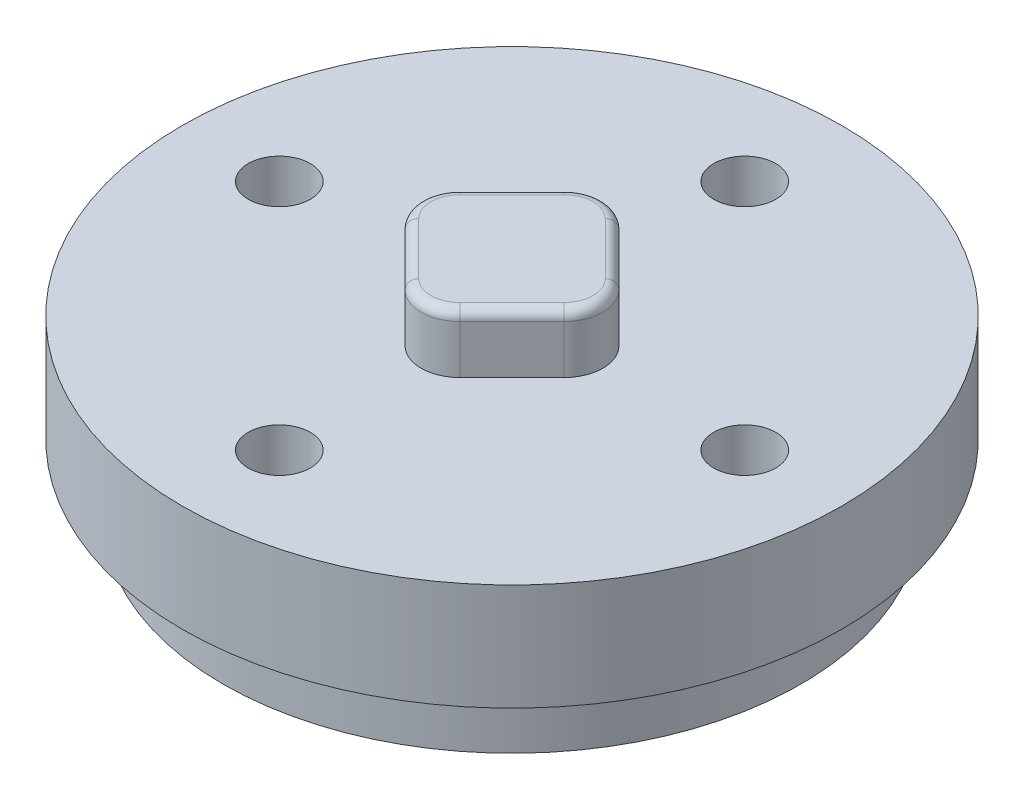
ISO-10303-21;
HEADER;
FILE_DESCRIPTION(('STEP AP214'),'2;1');
FILE_NAME('part.step','',(''),(''),'','','');
FILE_SCHEMA(('AUTOMOTIVE_DESIGN { 1 0 10303 214 1 1 1 1 }'));
ENDSEC;
DATA;
#1=APPLICATION_CONTEXT('core data for automotive mechanical design processes');
#2=APPLICATION_PROTOCOL_DEFINITION('international standard','automotive_design',2000,#1);
#3=PRODUCT_CONTEXT('',#1,'mechanical');
#4=PRODUCT('Part','Part','',(#3));
#5=PRODUCT_RELATED_PRODUCT_CATEGORY('part','',(#4));
#6=PRODUCT_DEFINITION_FORMATION('','',#4);
#7=PRODUCT_DEFINITION_CONTEXT('part definition',#1,'design');
#8=PRODUCT_DEFINITION('design','',#6,#7);
#9=PRODUCT_DEFINITION_SHAPE('','',#8);
#10=(LENGTH_UNIT() NAMED_UNIT(*) SI_UNIT(.MILLI.,.METRE.));
#11=(NAMED_UNIT(*) PLANE_ANGLE_UNIT() SI_UNIT($,.RADIAN.));
#12=(NAMED_UNIT(*) SI_UNIT($,.STERADIAN.) SOLID_ANGLE_UNIT());
#13=UNCERTAINTY_MEASURE_WITH_UNIT(LENGTH_MEASURE(1.E-05),#10,'distance_accuracy_value','');
#14=(GEOMETRIC_REPRESENTATION_CONTEXT(3) GLOBAL_UNCERTAINTY_ASSIGNED_CONTEXT((#13)) GLOBAL_UNIT_ASSIGNED_CONTEXT((#10,
#11,#12)) REPRESENTATION_CONTEXT('',''));
#15=CARTESIAN_POINT('',(0.,0.,0.));
#16=DIRECTION('',(0.,0.,1.));
#17=DIRECTION('',(1.,0.,0.));
#18=AXIS2_PLACEMENT_3D('',#15,#16,#17);
#19=CARTESIAN_POINT('',(0.,9.,0.));
#20=DIRECTION('',(0.,1.,0.));
#21=DIRECTION('',(0.,0.,1.));
#22=AXIS2_PLACEMENT_3D('',#19,#20,#21);
#23=PLANE('',#22);
#24=CARTESIAN_POINT('',(-11.9999999999997,9.,3.4032572508536E-13));
#25=DIRECTION('',(0.,1.,0.));
#26=DIRECTION('',(0.,0.,1.));
#27=AXIS2_PLACEMENT_3D('',#24,#25,#26);
#28=CIRCLE('',#27,1.6);
#29=CARTESIAN_POINT('',(-11.9999999999997,9.,1.60000000000034));
#30=VERTEX_POINT('',#29);
#31=EDGE_CURVE('E183',#30,#30,#28,.T.);
#32=ORIENTED_EDGE('',*,*,#31,.F.);
#33=EDGE_LOOP('',(#32));
#34=FACE_BOUND('',#33,.T.);
#35=CARTESIAN_POINT('',(12.0000000000003,9.,-3.38856148926383E-13));
#36=DIRECTION('',(0.,1.,0.));
#37=DIRECTION('',(0.,0.,1.));
#38=AXIS2_PLACEMENT_3D('',#35,#36,#37);
#39=CIRCLE('',#38,1.6);
#40=CARTESIAN_POINT('',(12.0000000000003,9.,1.59999999999966));
#41=VERTEX_POINT('',#40);
#42=EDGE_CURVE('E189',#41,#41,#39,.T.);
#43=ORIENTED_EDGE('',*,*,#42,.F.);
#44=EDGE_LOOP('',(#43));
#45=FACE_BOUND('',#44,.T.);
#46=CARTESIAN_POINT('',(0.,9.,0.));
#47=DIRECTION('',(0.,1.,0.));
#48=DIRECTION('',(0.,0.,1.));
#49=AXIS2_PLACEMENT_3D('',#46,#47,#48);
#50=CIRCLE('',#49,17.);
#51=CARTESIAN_POINT('',(0.,9.,17.));
#52=VERTEX_POINT('',#51);
#53=EDGE_CURVE('E193',#52,#52,#50,.T.);
#54=ORIENTED_EDGE('',*,*,#53,.T.);
#55=EDGE_LOOP('',(#54));
#56=FACE_BOUND('',#55,.T.);
#57=CARTESIAN_POINT('',(6.77712297852766E-13,9.,12.));
#58=DIRECTION('',(0.,1.,0.));
#59=DIRECTION('',(0.,0.,1.));
#60=AXIS2_PLACEMENT_3D('',#57,#58,#59);
#61=CIRCLE('',#60,1.6);
#62=CARTESIAN_POINT('',(6.77712297852766E-13,9.,13.6));
#63=VERTEX_POINT('',#62);
#64=EDGE_CURVE('E186',#63,#63,#61,.T.);
#65=ORIENTED_EDGE('',*,*,#64,.F.);
#66=EDGE_LOOP('',(#65));
#67=FACE_BOUND('',#66,.T.);
#68=CARTESIAN_POINT('',(0.,9.,-12.));
#69=DIRECTION('',(0.,1.,0.));
#70=DIRECTION('',(0.,0.,1.));
#71=AXIS2_PLACEMENT_3D('',#68,#69,#70);
#72=CIRCLE('',#71,1.6);
#73=CARTESIAN_POINT('',(0.,9.,-10.4));
#74=VERTEX_POINT('',#73);
#75=EDGE_CURVE('E138',#74,#74,#72,.T.);
#76=ORIENTED_EDGE('',*,*,#75,.F.);
#77=EDGE_LOOP('',(#76));
#78=FACE_BOUND('',#77,.T.);
#79=DIRECTION('',(-0.707106781186548,0.,-0.707106781186547));
#80=VECTOR('',#79,1.);
#81=CARTESIAN_POINT('',(1.41421356237309,9.,-4.10121933088198));
#82=LINE('',#81,#80);
#83=CARTESIAN_POINT('',(4.10121933088198,9.,-1.41421356237309));
#84=VERTEX_POINT('',#83);
#85=CARTESIAN_POINT('',(1.41421356237309,9.,-4.10121933088198));
#86=VERTEX_POINT('',#85);
#87=EDGE_CURVE('E135',#84,#86,#82,.T.);
#88=ORIENTED_EDGE('',*,*,#87,.F.);
#89=CARTESIAN_POINT('',(2.68700576850888,9.,0.));
#90=DIRECTION('',(0.,1.,0.));
#91=DIRECTION('',(0.,0.,-1.));
#92=AXIS2_PLACEMENT_3D('',#89,#90,#91);
#93=CIRCLE('',#92,2.);
#94=CARTESIAN_POINT('',(4.10121933088198,9.,1.41421356237309));
#95=VERTEX_POINT('',#94);
#96=EDGE_CURVE('E142',#95,#84,#93,.T.);
#97=ORIENTED_EDGE('',*,*,#96,.F.);
#98=DIRECTION('',(0.707106781186547,0.,-0.707106781186548));
#99=VECTOR('',#98,1.);
#100=CARTESIAN_POINT('',(1.4142135623731,9.,4.10121933088198));
#101=LINE('',#100,#99);
#102=CARTESIAN_POINT('',(1.4142135623731,9.,4.10121933088198));
#103=VERTEX_POINT('',#102);
#104=EDGE_CURVE('E167',#103,#95,#101,.T.);
#105=ORIENTED_EDGE('',*,*,#104,.F.);
#106=CARTESIAN_POINT('',(0.,9.,2.68700576850888));
#107=DIRECTION('',(0.,1.,0.));
#108=DIRECTION('',(0.,0.,1.));
#109=AXIS2_PLACEMENT_3D('',#106,#107,#108);
#110=CIRCLE('',#109,2.);
#111=CARTESIAN_POINT('',(-1.41421356237309,9.,4.10121933088198));
#112=VERTEX_POINT('',#111);
#113=EDGE_CURVE('E164',#112,#103,#110,.T.);
#114=ORIENTED_EDGE('',*,*,#113,.F.);
#115=DIRECTION('',(0.707106781186547,0.,0.707106781186548));
#116=VECTOR('',#115,1.);
#117=CARTESIAN_POINT('',(-4.10121933088198,9.,1.41421356237309));
#118=LINE('',#117,#116);
#119=CARTESIAN_POINT('',(-4.10121933088198,9.,1.41421356237309));
#120=VERTEX_POINT('',#119);
#121=EDGE_CURVE('E161',#120,#112,#118,.T.);
#122=ORIENTED_EDGE('',*,*,#121,.F.);
#123=CARTESIAN_POINT('',(-2.68700576850888,9.,0.));
#124=DIRECTION('',(0.,1.,0.));
#125=DIRECTION('',(0.,0.,-1.));
#126=AXIS2_PLACEMENT_3D('',#123,#124,#125);
#127=CIRCLE('',#126,2.);
#128=CARTESIAN_POINT('',(-4.10121933088198,9.,-1.41421356237309));
#129=VERTEX_POINT('',#128);
#130=EDGE_CURVE('E158',#129,#120,#127,.T.);
#131=ORIENTED_EDGE('',*,*,#130,.F.);
#132=DIRECTION('',(-0.707106781186547,0.,0.707106781186548));
#133=VECTOR('',#132,1.);
#134=CARTESIAN_POINT('',(-4.10121933088198,9.,-1.41421356237309));
#135=LINE('',#134,#133);
#136=CARTESIAN_POINT('',(-1.4142135623731,9.,-4.10121933088198));
#137=VERTEX_POINT('',#136);
#138=EDGE_CURVE('E153',#137,#129,#135,.T.);
#139=ORIENTED_EDGE('',*,*,#138,.F.);
#140=CARTESIAN_POINT('',(0.,9.,-2.68700576850888));
#141=DIRECTION('',(0.,1.,0.));
#142=DIRECTION('',(0.,0.,-1.));
#143=AXIS2_PLACEMENT_3D('',#140,#141,#142);
#144=CIRCLE('',#143,2.);
#145=EDGE_CURVE('E151',#86,#137,#144,.T.);
#146=ORIENTED_EDGE('',*,*,#145,.F.);
#147=EDGE_LOOP('',(#88,#97,#105,#114,#122,#131,#139,#146));
#148=FACE_BOUND('',#147,.T.);
#149=ADVANCED_FACE('F43',(#34,#45,#56,#67,#78,#148),#23,.T.);
#150=CARTESIAN_POINT('',(0.,3.5,0.));
#151=DIRECTION('',(0.,-1.,0.));
#152=DIRECTION('',(0.,0.,-1.));
#153=AXIS2_PLACEMENT_3D('',#150,#151,#152);
#154=CYLINDRICAL_SURFACE('',#153,14.9);
#155=CARTESIAN_POINT('',(0.,3.5,0.));
#156=DIRECTION('',(0.,1.,0.));
#157=DIRECTION('',(0.,0.,1.));
#158=AXIS2_PLACEMENT_3D('',#155,#156,#157);
#159=CIRCLE('',#158,14.9);
#160=CARTESIAN_POINT('',(0.,3.5,14.9));
#161=VERTEX_POINT('',#160);
#162=EDGE_CURVE('E199',#161,#161,#159,.T.);
#163=ORIENTED_EDGE('',*,*,#162,.F.);
#164=EDGE_LOOP('',(#163));
#165=FACE_BOUND('',#164,.T.);
#166=CARTESIAN_POINT('',(0.,0.,0.));
#167=DIRECTION('',(0.,1.,0.));
#168=DIRECTION('',(0.,0.,1.));
#169=AXIS2_PLACEMENT_3D('',#166,#167,#168);
#170=CIRCLE('',#169,14.9);
#171=CARTESIAN_POINT('',(0.,0.,14.9));
#172=VERTEX_POINT('',#171);
#173=EDGE_CURVE('E203',#172,#172,#170,.T.);
#174=ORIENTED_EDGE('',*,*,#173,.T.);
#175=EDGE_LOOP('',(#174));
#176=FACE_BOUND('',#175,.T.);
#177=ADVANCED_FACE('F346',(#165,#176),#154,.T.);
#178=CARTESIAN_POINT('',(0.,3.5,-12.));
#179=DIRECTION('',(0.,-1.,0.));
#180=DIRECTION('',(0.,0.,-1.));
#181=AXIS2_PLACEMENT_3D('',#178,#179,#180);
#182=CYLINDRICAL_SURFACE('',#181,1.6);
#183=CARTESIAN_POINT('',(0.,0.,-12.));
#184=DIRECTION('',(0.,1.,0.));
#185=DIRECTION('',(0.,0.,1.));
#186=AXIS2_PLACEMENT_3D('',#183,#184,#185);
#187=CIRCLE('',#186,1.6);
#188=CARTESIAN_POINT('',(0.,0.,-10.4));
#189=VERTEX_POINT('',#188);
#190=EDGE_CURVE('E212',#189,#189,#187,.T.);
#191=ORIENTED_EDGE('',*,*,#190,.F.);
#192=EDGE_LOOP('',(#191));
#193=FACE_BOUND('',#192,.T.);
#194=ORIENTED_EDGE('',*,*,#75,.T.);
#195=EDGE_LOOP('',(#194));
#196=FACE_BOUND('',#195,.T.);
#197=ADVANCED_FACE('F352',(#193,#196),#182,.F.);
#198=CARTESIAN_POINT('',(12.0000000000003,3.5,-3.38856148926383E-13));
#199=DIRECTION('',(0.,-1.,0.));
#200=DIRECTION('',(0.,0.,-1.));
#201=AXIS2_PLACEMENT_3D('',#198,#199,#200);
#202=CYLINDRICAL_SURFACE('',#201,1.6);
#203=CARTESIAN_POINT('',(12.0000000000003,0.,-3.38856148926383E-13));
#204=DIRECTION('',(0.,1.,0.));
#205=DIRECTION('',(0.,0.,1.));
#206=AXIS2_PLACEMENT_3D('',#203,#204,#205);
#207=CIRCLE('',#206,1.6);
#208=CARTESIAN_POINT('',(12.0000000000003,0.,1.59999999999966));
#209=VERTEX_POINT('',#208);
#210=EDGE_CURVE('E209',#209,#209,#207,.T.);
#211=ORIENTED_EDGE('',*,*,#210,.F.);
#212=EDGE_LOOP('',(#211));
#213=FACE_BOUND('',#212,.T.);
#214=ORIENTED_EDGE('',*,*,#42,.T.);
#215=EDGE_LOOP('',(#214));
#216=FACE_BOUND('',#215,.T.);
#217=ADVANCED_FACE('F393',(#213,#216),#202,.F.);
#218=CARTESIAN_POINT('',(6.77712297852766E-13,3.5,12.));
#219=DIRECTION('',(0.,-1.,0.));
#220=DIRECTION('',(0.,0.,-1.));
#221=AXIS2_PLACEMENT_3D('',#218,#219,#220);
#222=CYLINDRICAL_SURFACE('',#221,1.6);
#223=CARTESIAN_POINT('',(6.77712297852766E-13,0.,12.));
#224=DIRECTION('',(0.,1.,0.));
#225=DIRECTION('',(0.,0.,1.));
#226=AXIS2_PLACEMENT_3D('',#223,#224,#225);
#227=CIRCLE('',#226,1.6);
#228=CARTESIAN_POINT('',(6.77712297852766E-13,0.,13.6));
#229=VERTEX_POINT('',#228);
#230=EDGE_CURVE('E206',#229,#229,#227,.T.);
#231=ORIENTED_EDGE('',*,*,#230,.F.);
#232=EDGE_LOOP('',(#231));
#233=FACE_BOUND('',#232,.T.);
#234=ORIENTED_EDGE('',*,*,#64,.T.);
#235=EDGE_LOOP('',(#234));
#236=FACE_BOUND('',#235,.T.);
#237=ADVANCED_FACE('F397',(#233,#236),#222,.F.);
#238=CARTESIAN_POINT('',(-11.9999999999997,3.5,3.4032572508536E-13));
#239=DIRECTION('',(0.,-1.,0.));
#240=DIRECTION('',(0.,0.,-1.));
#241=AXIS2_PLACEMENT_3D('',#238,#239,#240);
#242=CYLINDRICAL_SURFACE('',#241,1.6);
#243=CARTESIAN_POINT('',(-11.9999999999997,0.,3.4032572508536E-13));
#244=DIRECTION('',(0.,1.,0.));
#245=DIRECTION('',(0.,0.,1.));
#246=AXIS2_PLACEMENT_3D('',#243,#244,#245);
#247=CIRCLE('',#246,1.6);
#248=CARTESIAN_POINT('',(-11.9999999999997,0.,1.60000000000034));
#249=VERTEX_POINT('',#248);
#250=EDGE_CURVE('E196',#249,#249,#247,.T.);
#251=ORIENTED_EDGE('',*,*,#250,.F.);
#252=EDGE_LOOP('',(#251));
#253=FACE_BOUND('',#252,.T.);
#254=ORIENTED_EDGE('',*,*,#31,.T.);
#255=EDGE_LOOP('',(#254));
#256=FACE_BOUND('',#255,.T.);
#257=ADVANCED_FACE('F388',(#253,#256),#242,.F.);
#258=CARTESIAN_POINT('',(0.,0.,0.));
#259=DIRECTION('',(0.,1.,0.));
#260=DIRECTION('',(0.,0.,1.));
#261=AXIS2_PLACEMENT_3D('',#258,#259,#260);
#262=PLANE('',#261);
#263=CARTESIAN_POINT('',(-3.50000000000002,0.,3.49999999999998));
#264=DIRECTION('',(0.,1.,0.));
#265=DIRECTION('',(0.,0.,1.));
#266=AXIS2_PLACEMENT_3D('',#263,#264,#265);
#267=CIRCLE('',#266,1.5);
#268=CARTESIAN_POINT('',(-3.50000000000002,0.,4.99999999999998));
#269=VERTEX_POINT('',#268);
#270=EDGE_CURVE('E219',#269,#269,#267,.F.);
#271=ORIENTED_EDGE('',*,*,#270,.F.);
#272=EDGE_LOOP('',(#271));
#273=FACE_BOUND('',#272,.T.);
#274=CARTESIAN_POINT('',(3.5,0.,-3.5));
#275=DIRECTION('',(0.,1.,0.));
#276=DIRECTION('',(0.,0.,1.));
#277=AXIS2_PLACEMENT_3D('',#274,#275,#276);
#278=CIRCLE('',#277,1.5);
#279=CARTESIAN_POINT('',(3.5,0.,-2.));
#280=VERTEX_POINT('',#279);
#281=EDGE_CURVE('E202',#280,#280,#278,.F.);
#282=ORIENTED_EDGE('',*,*,#281,.F.);
#283=EDGE_LOOP('',(#282));
#284=FACE_BOUND('',#283,.T.);
#285=ORIENTED_EDGE('',*,*,#250,.T.);
#286=EDGE_LOOP('',(#285));
#287=FACE_BOUND('',#286,.T.);
#288=ORIENTED_EDGE('',*,*,#230,.T.);
#289=EDGE_LOOP('',(#288));
#290=FACE_BOUND('',#289,.T.);
#291=ORIENTED_EDGE('',*,*,#210,.T.);
#292=EDGE_LOOP('',(#291));
#293=FACE_BOUND('',#292,.T.);
#294=ORIENTED_EDGE('',*,*,#190,.T.);
#295=EDGE_LOOP('',(#294));
#296=FACE_BOUND('',#295,.T.);
#297=ORIENTED_EDGE('',*,*,#173,.F.);
#298=EDGE_LOOP('',(#297));
#299=FACE_BOUND('',#298,.T.);
#300=ADVANCED_FACE('F385',(#273,#284,#287,#290,#293,#296,#299),#262,.F.);
#301=CARTESIAN_POINT('',(3.5,-2.,-3.5));
#302=DIRECTION('',(0.,1.,0.));
#303=DIRECTION('',(0.,0.,1.));
#304=AXIS2_PLACEMENT_3D('',#301,#302,#303);
#305=CYLINDRICAL_SURFACE('',#304,1.5);
#306=CARTESIAN_POINT('',(3.5,-1.7,-3.5));
#307=DIRECTION('',(0.,-1.,0.));
#308=DIRECTION('',(0.,0.,-1.));
#309=AXIS2_PLACEMENT_3D('',#306,#307,#308);
#310=CIRCLE('',#309,1.5);
#311=CARTESIAN_POINT('',(3.5,-1.7,-5.));
#312=VERTEX_POINT('',#311);
#313=EDGE_CURVE('E225',#312,#312,#310,.F.);
#314=ORIENTED_EDGE('',*,*,#313,.T.);
#315=EDGE_LOOP('',(#314));
#316=FACE_BOUND('',#315,.T.);
#317=ORIENTED_EDGE('',*,*,#281,.T.);
#318=EDGE_LOOP('',(#317));
#319=FACE_BOUND('',#318,.T.);
#320=ADVANCED_FACE('F381',(#316,#319),#305,.T.);
#321=CARTESIAN_POINT('',(3.5,-2.,-3.5));
#322=DIRECTION('',(0.,-1.,0.));
#323=DIRECTION('',(0.,0.,-1.));
#324=AXIS2_PLACEMENT_3D('',#321,#322,#323);
#325=PLANE('',#324);
#326=CARTESIAN_POINT('',(3.5,-2.,-3.5));
#327=DIRECTION('',(0.,-1.,0.));
#328=DIRECTION('',(0.,0.,-1.));
#329=AXIS2_PLACEMENT_3D('',#326,#327,#328);
#330=CIRCLE('',#329,1.2);
#331=CARTESIAN_POINT('',(3.5,-2.,-4.7));
#332=VERTEX_POINT('',#331);
#333=EDGE_CURVE('E222',#332,#332,#330,.T.);
#334=ORIENTED_EDGE('',*,*,#333,.T.);
#335=EDGE_LOOP('',(#334));
#336=FACE_BOUND('',#335,.T.);
#337=ADVANCED_FACE('F377',(#336),#325,.T.);
#338=CARTESIAN_POINT('',(-3.50000000000002,-2.,3.49999999999998));
#339=DIRECTION('',(0.,1.,0.));
#340=DIRECTION('',(0.,0.,1.));
#341=AXIS2_PLACEMENT_3D('',#338,#339,#340);
#342=CYLINDRICAL_SURFACE('',#341,1.5);
#343=CARTESIAN_POINT('',(-3.50000000000002,-1.7,3.49999999999998));
#344=DIRECTION('',(0.,-1.,0.));
#345=DIRECTION('',(0.,0.,-1.));
#346=AXIS2_PLACEMENT_3D('',#343,#344,#345);
#347=CIRCLE('',#346,1.5);
#348=CARTESIAN_POINT('',(-3.50000000000002,-1.7,1.99999999999998));
#349=VERTEX_POINT('',#348);
#350=EDGE_CURVE('E231',#349,#349,#347,.F.);
#351=ORIENTED_EDGE('',*,*,#350,.T.);
#352=EDGE_LOOP('',(#351));
#353=FACE_BOUND('',#352,.T.);
#354=ORIENTED_EDGE('',*,*,#270,.T.);
#355=EDGE_LOOP('',(#354));
#356=FACE_BOUND('',#355,.T.);
#357=ADVANCED_FACE('F373',(#353,#356),#342,.T.);
#358=CARTESIAN_POINT('',(-3.50000000000002,-2.,3.49999999999998));
#359=DIRECTION('',(0.,-1.,0.));
#360=DIRECTION('',(0.,0.,-1.));
#361=AXIS2_PLACEMENT_3D('',#358,#359,#360);
#362=PLANE('',#361);
#363=CARTESIAN_POINT('',(-3.50000000000002,-2.,3.49999999999998));
#364=DIRECTION('',(0.,-1.,0.));
#365=DIRECTION('',(0.,0.,-1.));
#366=AXIS2_PLACEMENT_3D('',#363,#364,#365);
#367=CIRCLE('',#366,1.2);
#368=CARTESIAN_POINT('',(-3.50000000000002,-2.,2.29999999999998));
#369=VERTEX_POINT('',#368);
#370=EDGE_CURVE('E228',#369,#369,#367,.T.);
#371=ORIENTED_EDGE('',*,*,#370,.T.);
#372=EDGE_LOOP('',(#371));
#373=FACE_BOUND('',#372,.T.);
#374=ADVANCED_FACE('F369',(#373),#362,.T.);
#375=CARTESIAN_POINT('',(3.5,-1.7,-3.5));
#376=DIRECTION('',(0.,-1.,0.));
#377=DIRECTION('',(0.,0.,-1.));
#378=AXIS2_PLACEMENT_3D('',#375,#376,#377);
#379=TOROIDAL_SURFACE('',#378,1.2,0.3);
#380=ORIENTED_EDGE('',*,*,#313,.F.);
#381=EDGE_LOOP('',(#380));
#382=FACE_BOUND('',#381,.T.);
#383=ORIENTED_EDGE('',*,*,#333,.F.);
#384=EDGE_LOOP('',(#383));
#385=FACE_BOUND('',#384,.T.);
#386=ADVANCED_FACE('F372',(#382,#385),#379,.T.);
#387=CARTESIAN_POINT('',(-3.50000000000002,-1.7,3.49999999999998));
#388=DIRECTION('',(0.,-1.,0.));
#389=DIRECTION('',(0.,0.,-1.));
#390=AXIS2_PLACEMENT_3D('',#387,#388,#389);
#391=TOROIDAL_SURFACE('',#390,1.2,0.3);
#392=ORIENTED_EDGE('',*,*,#350,.F.);
#393=EDGE_LOOP('',(#392));
#394=FACE_BOUND('',#393,.T.);
#395=ORIENTED_EDGE('',*,*,#370,.F.);
#396=EDGE_LOOP('',(#395));
#397=FACE_BOUND('',#396,.T.);
#398=ADVANCED_FACE('F364',(#394,#397),#391,.T.);
#399=CARTESIAN_POINT('',(0.,3.5,0.));
#400=DIRECTION('',(0.,1.,0.));
#401=DIRECTION('',(0.,0.,1.));
#402=AXIS2_PLACEMENT_3D('',#399,#400,#401);
#403=PLANE('',#402);
#404=ORIENTED_EDGE('',*,*,#162,.T.);
#405=EDGE_LOOP('',(#404));
#406=FACE_BOUND('',#405,.T.);
#407=CARTESIAN_POINT('',(0.,3.5,0.));
#408=DIRECTION('',(0.,1.,0.));
#409=DIRECTION('',(0.,0.,1.));
#410=AXIS2_PLACEMENT_3D('',#407,#408,#409);
#411=CIRCLE('',#410,17.);
#412=CARTESIAN_POINT('',(0.,3.5,17.));
#413=VERTEX_POINT('',#412);
#414=EDGE_CURVE('E192',#413,#413,#411,.T.);
#415=ORIENTED_EDGE('',*,*,#414,.F.);
#416=EDGE_LOOP('',(#415));
#417=FACE_BOUND('',#416,.T.);
#418=ADVANCED_FACE('F360',(#406,#417),#403,.F.);
#419=CARTESIAN_POINT('',(0.,9.,0.));
#420=DIRECTION('',(0.,-1.,0.));
#421=DIRECTION('',(0.,0.,-1.));
#422=AXIS2_PLACEMENT_3D('',#419,#420,#421);
#423=CYLINDRICAL_SURFACE('',#422,17.);
#424=ORIENTED_EDGE('',*,*,#53,.F.);
#425=EDGE_LOOP('',(#424));
#426=FACE_BOUND('',#425,.T.);
#427=ORIENTED_EDGE('',*,*,#414,.T.);
#428=EDGE_LOOP('',(#427));
#429=FACE_BOUND('',#428,.T.);
#430=ADVANCED_FACE('F363',(#426,#429),#423,.T.);
#431=CARTESIAN_POINT('',(2.68700576850888,12.,0.));
#432=DIRECTION('',(0.,-1.,0.));
#433=DIRECTION('',(0.,0.,-1.));
#434=AXIS2_PLACEMENT_3D('',#431,#432,#433);
#435=CYLINDRICAL_SURFACE('',#434,2.);
#436=DIRECTION('',(0.,-1.,0.));
#437=VECTOR('',#436,1.);
#438=CARTESIAN_POINT('',(4.10121933088198,12.,-1.41421356237309));
#439=LINE('',#438,#437);
#440=CARTESIAN_POINT('',(4.10121933088198,11.5,-1.41421356237309));
#441=VERTEX_POINT('',#440);
#442=EDGE_CURVE('E131',#441,#84,#439,.T.);
#443=ORIENTED_EDGE('',*,*,#442,.F.);
#444=CARTESIAN_POINT('',(2.68700576850888,11.5,0.));
#445=DIRECTION('',(0.,-1.,0.));
#446=DIRECTION('',(0.,0.,-1.));
#447=AXIS2_PLACEMENT_3D('',#444,#445,#446);
#448=CIRCLE('',#447,2.);
#449=CARTESIAN_POINT('',(4.10121933088198,11.5,1.41421356237309));
#450=VERTEX_POINT('',#449);
#451=EDGE_CURVE('E52',#441,#450,#448,.T.);
#452=ORIENTED_EDGE('',*,*,#451,.T.);
#453=DIRECTION('',(0.,-1.,0.));
#454=VECTOR('',#453,1.);
#455=CARTESIAN_POINT('',(4.10121933088198,12.,1.41421356237309));
#456=LINE('',#455,#454);
#457=EDGE_CURVE('E144',#450,#95,#456,.T.);
#458=ORIENTED_EDGE('',*,*,#457,.T.);
#459=ORIENTED_EDGE('',*,*,#96,.T.);
#460=EDGE_LOOP('',(#443,#452,#458,#459));
#461=FACE_BOUND('',#460,.T.);
#462=ADVANCED_FACE('F143',(#461),#435,.T.);
#463=CARTESIAN_POINT('',(1.41421356237309,12.,-4.10121933088198));
#464=DIRECTION('',(-0.707106781186547,0.,0.707106781186548));
#465=DIRECTION('',(0.707106781186548,0.,0.707106781186547));
#466=AXIS2_PLACEMENT_3D('',#463,#464,#465);
#467=PLANE('',#466);
#468=DIRECTION('',(0.,-1.,0.));
#469=VECTOR('',#468,1.);
#470=CARTESIAN_POINT('',(1.41421356237309,12.,-4.10121933088198));
#471=LINE('',#470,#469);
#472=CARTESIAN_POINT('',(1.41421356237309,11.5,-4.10121933088198));
#473=VERTEX_POINT('',#472);
#474=EDGE_CURVE('E139',#473,#86,#471,.T.);
#475=ORIENTED_EDGE('',*,*,#474,.F.);
#476=DIRECTION('',(-0.707106781186548,0.,-0.707106781186547));
#477=VECTOR('',#476,1.);
#478=CARTESIAN_POINT('',(1.41421356237309,11.5,-4.10121933088198));
#479=LINE('',#478,#477);
#480=EDGE_CURVE('E67',#473,#441,#479,.F.);
#481=ORIENTED_EDGE('',*,*,#480,.T.);
#482=ORIENTED_EDGE('',*,*,#442,.T.);
#483=ORIENTED_EDGE('',*,*,#87,.T.);
#484=EDGE_LOOP('',(#475,#481,#482,#483));
#485=FACE_BOUND('',#484,.T.);
#486=ADVANCED_FACE('F133',(#485),#467,.F.);
#487=CARTESIAN_POINT('',(0.,12.,-2.68700576850888));
#488=DIRECTION('',(0.,-1.,0.));
#489=DIRECTION('',(0.,0.,-1.));
#490=AXIS2_PLACEMENT_3D('',#487,#488,#489);
#491=CYLINDRICAL_SURFACE('',#490,2.);
#492=DIRECTION('',(0.,-1.,0.));
#493=VECTOR('',#492,1.);
#494=CARTESIAN_POINT('',(-1.4142135623731,12.,-4.10121933088198));
#495=LINE('',#494,#493);
#496=CARTESIAN_POINT('',(-1.4142135623731,11.5,-4.10121933088198));
#497=VERTEX_POINT('',#496);
#498=EDGE_CURVE('E178',#497,#137,#495,.T.);
#499=ORIENTED_EDGE('',*,*,#498,.F.);
#500=CARTESIAN_POINT('',(0.,11.5,-2.68700576850888));
#501=DIRECTION('',(0.,-1.,0.));
#502=DIRECTION('',(0.,0.,-1.));
#503=AXIS2_PLACEMENT_3D('',#500,#501,#502);
#504=CIRCLE('',#503,2.);
#505=EDGE_CURVE('E260',#497,#473,#504,.T.);
#506=ORIENTED_EDGE('',*,*,#505,.T.);
#507=ORIENTED_EDGE('',*,*,#474,.T.);
#508=ORIENTED_EDGE('',*,*,#145,.T.);
#509=EDGE_LOOP('',(#499,#506,#507,#508));
#510=FACE_BOUND('',#509,.T.);
#511=ADVANCED_FACE('F296',(#510),#491,.T.);
#512=CARTESIAN_POINT('',(-4.10121933088198,12.,-1.41421356237309));
#513=DIRECTION('',(0.707106781186548,0.,0.707106781186547));
#514=DIRECTION('',(0.707106781186547,0.,-0.707106781186548));
#515=AXIS2_PLACEMENT_3D('',#512,#513,#514);
#516=PLANE('',#515);
#517=DIRECTION('',(0.,-1.,0.));
#518=VECTOR('',#517,1.);
#519=CARTESIAN_POINT('',(-4.10121933088198,12.,-1.41421356237309));
#520=LINE('',#519,#518);
#521=CARTESIAN_POINT('',(-4.10121933088198,11.5,-1.41421356237309));
#522=VERTEX_POINT('',#521);
#523=EDGE_CURVE('E176',#522,#129,#520,.T.);
#524=ORIENTED_EDGE('',*,*,#523,.F.);
#525=DIRECTION('',(-0.707106781186547,0.,0.707106781186548));
#526=VECTOR('',#525,1.);
#527=CARTESIAN_POINT('',(-4.10121933088198,11.5,-1.41421356237309));
#528=LINE('',#527,#526);
#529=EDGE_CURVE('E258',#522,#497,#528,.F.);
#530=ORIENTED_EDGE('',*,*,#529,.T.);
#531=ORIENTED_EDGE('',*,*,#498,.T.);
#532=ORIENTED_EDGE('',*,*,#138,.T.);
#533=EDGE_LOOP('',(#524,#530,#531,#532));
#534=FACE_BOUND('',#533,.T.);
#535=ADVANCED_FACE('F299',(#534),#516,.F.);
#536=CARTESIAN_POINT('',(-2.68700576850888,12.,0.));
#537=DIRECTION('',(0.,-1.,0.));
#538=DIRECTION('',(0.,0.,-1.));
#539=AXIS2_PLACEMENT_3D('',#536,#537,#538);
#540=CYLINDRICAL_SURFACE('',#539,2.);
#541=DIRECTION('',(0.,-1.,0.));
#542=VECTOR('',#541,1.);
#543=CARTESIAN_POINT('',(-4.10121933088198,12.,1.41421356237309));
#544=LINE('',#543,#542);
#545=CARTESIAN_POINT('',(-4.10121933088198,11.5,1.41421356237309));
#546=VERTEX_POINT('',#545);
#547=EDGE_CURVE('E174',#546,#120,#544,.T.);
#548=ORIENTED_EDGE('',*,*,#547,.F.);
#549=CARTESIAN_POINT('',(-2.68700576850888,11.5,0.));
#550=DIRECTION('',(0.,-1.,0.));
#551=DIRECTION('',(0.,0.,-1.));
#552=AXIS2_PLACEMENT_3D('',#549,#550,#551);
#553=CIRCLE('',#552,2.);
#554=EDGE_CURVE('E256',#546,#522,#553,.T.);
#555=ORIENTED_EDGE('',*,*,#554,.T.);
#556=ORIENTED_EDGE('',*,*,#523,.T.);
#557=ORIENTED_EDGE('',*,*,#130,.T.);
#558=EDGE_LOOP('',(#548,#555,#556,#557));
#559=FACE_BOUND('',#558,.T.);
#560=ADVANCED_FACE('F303',(#559),#540,.T.);
#561=CARTESIAN_POINT('',(-4.10121933088198,12.,1.41421356237309));
#562=DIRECTION('',(0.707106781186548,0.,-0.707106781186547));
#563=DIRECTION('',(-0.707106781186547,0.,-0.707106781186548));
#564=AXIS2_PLACEMENT_3D('',#561,#562,#563);
#565=PLANE('',#564);
#566=DIRECTION('',(0.,-1.,0.));
#567=VECTOR('',#566,1.);
#568=CARTESIAN_POINT('',(-1.41421356237309,12.,4.10121933088198));
#569=LINE('',#568,#567);
#570=CARTESIAN_POINT('',(-1.41421356237309,11.5,4.10121933088198));
#571=VERTEX_POINT('',#570);
#572=EDGE_CURVE('E172',#571,#112,#569,.T.);
#573=ORIENTED_EDGE('',*,*,#572,.F.);
#574=DIRECTION('',(0.707106781186547,0.,0.707106781186548));
#575=VECTOR('',#574,1.);
#576=CARTESIAN_POINT('',(-4.10121933088198,11.5,1.41421356237309));
#577=LINE('',#576,#575);
#578=EDGE_CURVE('E254',#571,#546,#577,.F.);
#579=ORIENTED_EDGE('',*,*,#578,.T.);
#580=ORIENTED_EDGE('',*,*,#547,.T.);
#581=ORIENTED_EDGE('',*,*,#121,.T.);
#582=EDGE_LOOP('',(#573,#579,#580,#581));
#583=FACE_BOUND('',#582,.T.);
#584=ADVANCED_FACE('F484',(#583),#565,.F.);
#585=CARTESIAN_POINT('',(0.,12.,2.68700576850888));
#586=DIRECTION('',(0.,-1.,0.));
#587=DIRECTION('',(0.,0.,-1.));
#588=AXIS2_PLACEMENT_3D('',#585,#586,#587);
#589=CYLINDRICAL_SURFACE('',#588,2.);
#590=DIRECTION('',(0.,-1.,0.));
#591=VECTOR('',#590,1.);
#592=CARTESIAN_POINT('',(1.4142135623731,12.,4.10121933088198));
#593=LINE('',#592,#591);
#594=CARTESIAN_POINT('',(1.4142135623731,11.5,4.10121933088198));
#595=VERTEX_POINT('',#594);
#596=EDGE_CURVE('E170',#595,#103,#593,.T.);
#597=ORIENTED_EDGE('',*,*,#596,.F.);
#598=CARTESIAN_POINT('',(0.,11.5,2.68700576850888));
#599=DIRECTION('',(0.,-1.,0.));
#600=DIRECTION('',(0.,0.,-1.));
#601=AXIS2_PLACEMENT_3D('',#598,#599,#600);
#602=CIRCLE('',#601,2.);
#603=EDGE_CURVE('E251',#595,#571,#602,.T.);
#604=ORIENTED_EDGE('',*,*,#603,.T.);
#605=ORIENTED_EDGE('',*,*,#572,.T.);
#606=ORIENTED_EDGE('',*,*,#113,.T.);
#607=EDGE_LOOP('',(#597,#604,#605,#606));
#608=FACE_BOUND('',#607,.T.);
#609=ADVANCED_FACE('F333',(#608),#589,.T.);
#610=CARTESIAN_POINT('',(1.4142135623731,12.,4.10121933088198));
#611=DIRECTION('',(-0.707106781186548,0.,-0.707106781186547));
#612=DIRECTION('',(-0.707106781186547,0.,0.707106781186548));
#613=AXIS2_PLACEMENT_3D('',#610,#611,#612);
#614=PLANE('',#613);
#615=ORIENTED_EDGE('',*,*,#457,.F.);
#616=DIRECTION('',(0.707106781186547,0.,-0.707106781186548));
#617=VECTOR('',#616,1.);
#618=CARTESIAN_POINT('',(1.4142135623731,11.5,4.10121933088198));
#619=LINE('',#618,#617);
#620=EDGE_CURVE('E12',#450,#595,#619,.F.);
#621=ORIENTED_EDGE('',*,*,#620,.T.);
#622=ORIENTED_EDGE('',*,*,#596,.T.);
#623=ORIENTED_EDGE('',*,*,#104,.T.);
#624=EDGE_LOOP('',(#615,#621,#622,#623));
#625=FACE_BOUND('',#624,.T.);
#626=ADVANCED_FACE('F330',(#625),#614,.F.);
#627=CARTESIAN_POINT('',(2.68700576850888,12.,0.));
#628=DIRECTION('',(0.,-1.,0.));
#629=DIRECTION('',(0.,0.,-1.));
#630=AXIS2_PLACEMENT_3D('',#627,#628,#629);
#631=PLANE('',#630);
#632=DIRECTION('',(0.707106781186547,0.,0.707106781186548));
#633=VECTOR('',#632,1.);
#634=CARTESIAN_POINT('',(-1.06066017177982,12.,3.7476659402887));
#635=LINE('',#634,#633);
#636=CARTESIAN_POINT('',(-3.7476659402887,12.,1.06066017177982));
#637=VERTEX_POINT('',#636);
#638=CARTESIAN_POINT('',(-1.06066017177982,12.,3.7476659402887));
#639=VERTEX_POINT('',#638);
#640=EDGE_CURVE('E246',#637,#639,#635,.T.);
#641=ORIENTED_EDGE('',*,*,#640,.T.);
#642=CARTESIAN_POINT('',(0.,12.,2.68700576850888));
#643=DIRECTION('',(0.,-1.,0.));
#644=DIRECTION('',(0.,0.,-1.));
#645=AXIS2_PLACEMENT_3D('',#642,#643,#644);
#646=CIRCLE('',#645,1.5);
#647=CARTESIAN_POINT('',(1.06066017177982,12.,3.7476659402887));
#648=VERTEX_POINT('',#647);
#649=EDGE_CURVE('E248',#639,#648,#646,.F.);
#650=ORIENTED_EDGE('',*,*,#649,.T.);
#651=DIRECTION('',(0.707106781186547,0.,-0.707106781186548));
#652=VECTOR('',#651,1.);
#653=CARTESIAN_POINT('',(3.7476659402887,12.,1.06066017177982));
#654=LINE('',#653,#652);
#655=CARTESIAN_POINT('',(3.7476659402887,12.,1.06066017177982));
#656=VERTEX_POINT('',#655);
#657=EDGE_CURVE('E234',#648,#656,#654,.T.);
#658=ORIENTED_EDGE('',*,*,#657,.T.);
#659=CARTESIAN_POINT('',(2.68700576850888,12.,0.));
#660=DIRECTION('',(0.,-1.,0.));
#661=DIRECTION('',(0.,0.,-1.));
#662=AXIS2_PLACEMENT_3D('',#659,#660,#661);
#663=CIRCLE('',#662,1.5);
#664=CARTESIAN_POINT('',(3.7476659402887,12.,-1.06066017177982));
#665=VERTEX_POINT('',#664);
#666=EDGE_CURVE('E236',#656,#665,#663,.F.);
#667=ORIENTED_EDGE('',*,*,#666,.T.);
#668=DIRECTION('',(-0.707106781186548,0.,-0.707106781186547));
#669=VECTOR('',#668,1.);
#670=CARTESIAN_POINT('',(3.7476659402887,12.,-1.06066017177982));
#671=LINE('',#670,#669);
#672=CARTESIAN_POINT('',(1.06066017177982,12.,-3.7476659402887));
#673=VERTEX_POINT('',#672);
#674=EDGE_CURVE('E238',#665,#673,#671,.T.);
#675=ORIENTED_EDGE('',*,*,#674,.T.);
#676=CARTESIAN_POINT('',(0.,12.,-2.68700576850888));
#677=DIRECTION('',(0.,-1.,0.));
#678=DIRECTION('',(0.,0.,-1.));
#679=AXIS2_PLACEMENT_3D('',#676,#677,#678);
#680=CIRCLE('',#679,1.5);
#681=CARTESIAN_POINT('',(-1.06066017177982,12.,-3.7476659402887));
#682=VERTEX_POINT('',#681);
#683=EDGE_CURVE('E240',#673,#682,#680,.F.);
#684=ORIENTED_EDGE('',*,*,#683,.T.);
#685=DIRECTION('',(-0.707106781186547,0.,0.707106781186548));
#686=VECTOR('',#685,1.);
#687=CARTESIAN_POINT('',(-1.06066017177982,12.,-3.7476659402887));
#688=LINE('',#687,#686);
#689=CARTESIAN_POINT('',(-3.7476659402887,12.,-1.06066017177982));
#690=VERTEX_POINT('',#689);
#691=EDGE_CURVE('E242',#682,#690,#688,.T.);
#692=ORIENTED_EDGE('',*,*,#691,.T.);
#693=CARTESIAN_POINT('',(-2.68700576850888,12.,0.));
#694=DIRECTION('',(0.,-1.,0.));
#695=DIRECTION('',(0.,0.,-1.));
#696=AXIS2_PLACEMENT_3D('',#693,#694,#695);
#697=CIRCLE('',#696,1.5);
#698=EDGE_CURVE('E244',#690,#637,#697,.F.);
#699=ORIENTED_EDGE('',*,*,#698,.T.);
#700=EDGE_LOOP('',(#641,#650,#658,#667,#675,#684,#692,#699));
#701=FACE_BOUND('',#700,.T.);
#702=ADVANCED_FACE('F317',(#701),#631,.F.);
#703=CARTESIAN_POINT('',(0.,11.5,-2.68700576850888));
#704=DIRECTION('',(0.,-1.,0.));
#705=DIRECTION('',(0.,0.,-1.));
#706=AXIS2_PLACEMENT_3D('',#703,#704,#705);
#707=TOROIDAL_SURFACE('',#706,1.5,0.5);
#708=CARTESIAN_POINT('',(1.06066017177982,11.5,-3.7476659402887));
#709=DIRECTION('',(0.707106781186547,0.,0.707106781186547));
#710=DIRECTION('',(0.707106781186548,0.,-0.707106781186548));
#711=AXIS2_PLACEMENT_3D('',#708,#709,#710);
#712=CIRCLE('',#711,0.5);
#713=EDGE_CURVE('E279',#473,#673,#712,.T.);
#714=ORIENTED_EDGE('',*,*,#713,.F.);
#715=ORIENTED_EDGE('',*,*,#505,.F.);
#716=CARTESIAN_POINT('',(-1.06066017177982,11.5,-3.7476659402887));
#717=DIRECTION('',(-0.707106781186547,0.,0.707106781186548));
#718=DIRECTION('',(0.707106781186548,0.,0.707106781186547));
#719=AXIS2_PLACEMENT_3D('',#716,#717,#718);
#720=CIRCLE('',#719,0.5);
#721=EDGE_CURVE('E47',#682,#497,#720,.T.);
#722=ORIENTED_EDGE('',*,*,#721,.F.);
#723=ORIENTED_EDGE('',*,*,#683,.F.);
#724=EDGE_LOOP('',(#714,#715,#722,#723));
#725=FACE_BOUND('',#724,.T.);
#726=ADVANCED_FACE('F45',(#725),#707,.T.);
#727=CARTESIAN_POINT('',(-1.06066017177982,11.5,-3.7476659402887));
#728=DIRECTION('',(-0.707106781186547,0.,0.707106781186548));
#729=DIRECTION('',(0.707106781186548,0.,0.707106781186547));
#730=AXIS2_PLACEMENT_3D('',#727,#728,#729);
#731=CYLINDRICAL_SURFACE('',#730,0.5);
#732=ORIENTED_EDGE('',*,*,#721,.T.);
#733=ORIENTED_EDGE('',*,*,#529,.F.);
#734=CARTESIAN_POINT('',(-3.7476659402887,11.5,-1.06066017177982));
#735=DIRECTION('',(-0.707106781186547,0.,0.707106781186548));
#736=DIRECTION('',(0.707106781186548,0.,0.707106781186547));
#737=AXIS2_PLACEMENT_3D('',#734,#735,#736);
#738=CIRCLE('',#737,0.5);
#739=EDGE_CURVE('E277',#690,#522,#738,.T.);
#740=ORIENTED_EDGE('',*,*,#739,.F.);
#741=ORIENTED_EDGE('',*,*,#691,.F.);
#742=EDGE_LOOP('',(#732,#733,#740,#741));
#743=FACE_BOUND('',#742,.T.);
#744=ADVANCED_FACE('F289',(#743),#731,.T.);
#745=CARTESIAN_POINT('',(3.7476659402887,11.5,-1.06066017177982));
#746=DIRECTION('',(-0.707106781186548,0.,-0.707106781186547));
#747=DIRECTION('',(-0.707106781186547,0.,0.707106781186548));
#748=AXIS2_PLACEMENT_3D('',#745,#746,#747);
#749=CYLINDRICAL_SURFACE('',#748,0.5);
#750=ORIENTED_EDGE('',*,*,#713,.T.);
#751=ORIENTED_EDGE('',*,*,#674,.F.);
#752=CARTESIAN_POINT('',(3.7476659402887,11.5,-1.06066017177982));
#753=DIRECTION('',(0.707106781186547,0.,0.707106781186547));
#754=DIRECTION('',(0.707106781186548,0.,-0.707106781186548));
#755=AXIS2_PLACEMENT_3D('',#752,#753,#754);
#756=CIRCLE('',#755,0.5);
#757=EDGE_CURVE('E274',#441,#665,#756,.T.);
#758=ORIENTED_EDGE('',*,*,#757,.F.);
#759=ORIENTED_EDGE('',*,*,#480,.F.);
#760=EDGE_LOOP('',(#750,#751,#758,#759));
#761=FACE_BOUND('',#760,.T.);
#762=ADVANCED_FACE('F319',(#761),#749,.T.);
#763=CARTESIAN_POINT('',(-2.68700576850888,11.5,0.));
#764=DIRECTION('',(0.,-1.,0.));
#765=DIRECTION('',(0.,0.,-1.));
#766=AXIS2_PLACEMENT_3D('',#763,#764,#765);
#767=TOROIDAL_SURFACE('',#766,1.5,0.5);
#768=ORIENTED_EDGE('',*,*,#739,.T.);
#769=ORIENTED_EDGE('',*,*,#554,.F.);
#770=CARTESIAN_POINT('',(-3.7476659402887,11.5,1.06066017177982));
#771=DIRECTION('',(0.707106781186547,0.,0.707106781186547));
#772=DIRECTION('',(0.707106781186548,0.,-0.707106781186548));
#773=AXIS2_PLACEMENT_3D('',#770,#771,#772);
#774=CIRCLE('',#773,0.5);
#775=EDGE_CURVE('E271',#637,#546,#774,.T.);
#776=ORIENTED_EDGE('',*,*,#775,.F.);
#777=ORIENTED_EDGE('',*,*,#698,.F.);
#778=EDGE_LOOP('',(#768,#769,#776,#777));
#779=FACE_BOUND('',#778,.T.);
#780=ADVANCED_FACE('F308',(#779),#767,.T.);
#781=CARTESIAN_POINT('',(2.68700576850888,11.5,0.));
#782=DIRECTION('',(0.,-1.,0.));
#783=DIRECTION('',(0.,0.,-1.));
#784=AXIS2_PLACEMENT_3D('',#781,#782,#783);
#785=TOROIDAL_SURFACE('',#784,1.5,0.5);
#786=ORIENTED_EDGE('',*,*,#757,.T.);
#787=ORIENTED_EDGE('',*,*,#666,.F.);
#788=CARTESIAN_POINT('',(3.7476659402887,11.5,1.06066017177982));
#789=DIRECTION('',(-0.707106781186547,0.,0.707106781186548));
#790=DIRECTION('',(0.707106781186548,0.,0.707106781186547));
#791=AXIS2_PLACEMENT_3D('',#788,#789,#790);
#792=CIRCLE('',#791,0.5);
#793=EDGE_CURVE('E268',#450,#656,#792,.T.);
#794=ORIENTED_EDGE('',*,*,#793,.F.);
#795=ORIENTED_EDGE('',*,*,#451,.F.);
#796=EDGE_LOOP('',(#786,#787,#794,#795));
#797=FACE_BOUND('',#796,.T.);
#798=ADVANCED_FACE('F321',(#797),#785,.T.);
#799=CARTESIAN_POINT('',(-1.06066017177982,11.5,3.7476659402887));
#800=DIRECTION('',(0.707106781186547,0.,0.707106781186548));
#801=DIRECTION('',(0.707106781186548,0.,-0.707106781186547));
#802=AXIS2_PLACEMENT_3D('',#799,#800,#801);
#803=CYLINDRICAL_SURFACE('',#802,0.5);
#804=ORIENTED_EDGE('',*,*,#775,.T.);
#805=ORIENTED_EDGE('',*,*,#578,.F.);
#806=CARTESIAN_POINT('',(-1.06066017177982,11.5,3.7476659402887));
#807=DIRECTION('',(0.707106781186547,0.,0.707106781186548));
#808=DIRECTION('',(0.707106781186548,0.,-0.707106781186547));
#809=AXIS2_PLACEMENT_3D('',#806,#807,#808);
#810=CIRCLE('',#809,0.5);
#811=EDGE_CURVE('E266',#639,#571,#810,.T.);
#812=ORIENTED_EDGE('',*,*,#811,.F.);
#813=ORIENTED_EDGE('',*,*,#640,.F.);
#814=EDGE_LOOP('',(#804,#805,#812,#813));
#815=FACE_BOUND('',#814,.T.);
#816=ADVANCED_FACE('F313',(#815),#803,.T.);
#817=CARTESIAN_POINT('',(3.7476659402887,11.5,1.06066017177982));
#818=DIRECTION('',(0.707106781186547,0.,-0.707106781186548));
#819=DIRECTION('',(-0.707106781186548,0.,-0.707106781186547));
#820=AXIS2_PLACEMENT_3D('',#817,#818,#819);
#821=CYLINDRICAL_SURFACE('',#820,0.5);
#822=ORIENTED_EDGE('',*,*,#793,.T.);
#823=ORIENTED_EDGE('',*,*,#657,.F.);
#824=CARTESIAN_POINT('',(1.06066017177982,11.5,3.7476659402887));
#825=DIRECTION('',(-0.707106781186547,0.,0.707106781186548));
#826=DIRECTION('',(0.707106781186548,0.,0.707106781186547));
#827=AXIS2_PLACEMENT_3D('',#824,#825,#826);
#828=CIRCLE('',#827,0.5);
#829=EDGE_CURVE('E264',#595,#648,#828,.T.);
#830=ORIENTED_EDGE('',*,*,#829,.F.);
#831=ORIENTED_EDGE('',*,*,#620,.F.);
#832=EDGE_LOOP('',(#822,#823,#830,#831));
#833=FACE_BOUND('',#832,.T.);
#834=ADVANCED_FACE('F327',(#833),#821,.T.);
#835=CARTESIAN_POINT('',(0.,11.5,2.68700576850888));
#836=DIRECTION('',(0.,-1.,0.));
#837=DIRECTION('',(0.,0.,-1.));
#838=AXIS2_PLACEMENT_3D('',#835,#836,#837);
#839=TOROIDAL_SURFACE('',#838,1.5,0.5);
#840=ORIENTED_EDGE('',*,*,#811,.T.);
#841=ORIENTED_EDGE('',*,*,#603,.F.);
#842=ORIENTED_EDGE('',*,*,#829,.T.);
#843=ORIENTED_EDGE('',*,*,#649,.F.);
#844=EDGE_LOOP('',(#840,#841,#842,#843));
#845=FACE_BOUND('',#844,.T.);
#846=ADVANCED_FACE('F337',(#845),#839,.T.);
#847=CLOSED_SHELL('',(#149,#177,#197,#217,#237,#257,#300,#320,#337,#357,#374,#386,#398,#418,
#430,#462,#486,#511,#535,#560,#584,#609,#626,#702,#726,#744,#762,#780,#798,#816,#834,#846));
#848=MANIFOLD_SOLID_BREP('B2',#847);
#849=ADVANCED_BREP_SHAPE_REPRESENTATION('',(#18,#848),#14);
#850=SHAPE_DEFINITION_REPRESENTATION(#9,#849);
ENDSEC;
END-ISO-10303-21;
